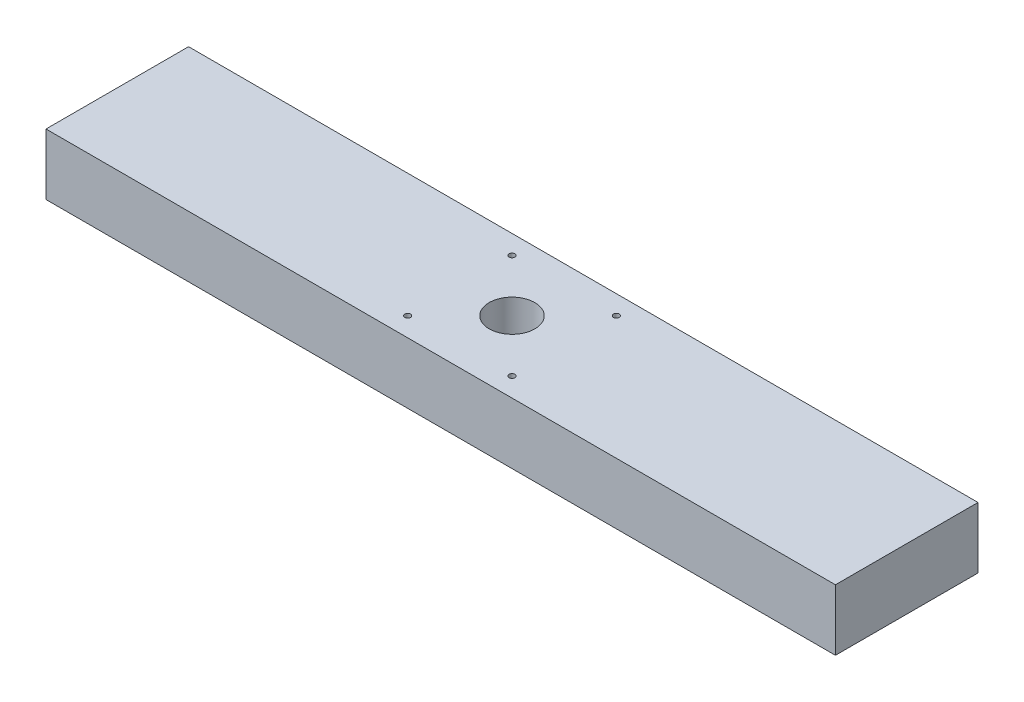
ISO-10303-21;
HEADER;
FILE_DESCRIPTION(('STEP AP214'),'2;1');
FILE_NAME('part.step','',(''),(''),'','','');
FILE_SCHEMA(('AUTOMOTIVE_DESIGN { 1 0 10303 214 1 1 1 1 }'));
ENDSEC;
DATA;
#1=APPLICATION_CONTEXT('core data for automotive mechanical design processes');
#2=APPLICATION_PROTOCOL_DEFINITION('international standard','automotive_design',2000,#1);
#3=PRODUCT_CONTEXT('',#1,'mechanical');
#4=PRODUCT('Part','Part','',(#3));
#5=PRODUCT_RELATED_PRODUCT_CATEGORY('part','',(#4));
#6=PRODUCT_DEFINITION_FORMATION('','',#4);
#7=PRODUCT_DEFINITION_CONTEXT('part definition',#1,'design');
#8=PRODUCT_DEFINITION('design','',#6,#7);
#9=PRODUCT_DEFINITION_SHAPE('','',#8);
#10=(LENGTH_UNIT() NAMED_UNIT(*) SI_UNIT(.MILLI.,.METRE.));
#11=(NAMED_UNIT(*) PLANE_ANGLE_UNIT() SI_UNIT($,.RADIAN.));
#12=(NAMED_UNIT(*) SI_UNIT($,.STERADIAN.) SOLID_ANGLE_UNIT());
#13=UNCERTAINTY_MEASURE_WITH_UNIT(LENGTH_MEASURE(1.E-05),#10,'distance_accuracy_value','');
#14=(GEOMETRIC_REPRESENTATION_CONTEXT(3) GLOBAL_UNCERTAINTY_ASSIGNED_CONTEXT((#13)) GLOBAL_UNIT_ASSIGNED_CONTEXT((#10,
#11,#12)) REPRESENTATION_CONTEXT('',''));
#15=CARTESIAN_POINT('',(0.,0.,0.));
#16=DIRECTION('',(0.,0.,1.));
#17=DIRECTION('',(1.,0.,0.));
#18=AXIS2_PLACEMENT_3D('',#15,#16,#17);
#19=CARTESIAN_POINT('',(-246.126,38.1,44.45));
#20=DIRECTION('',(1.,0.,0.));
#21=DIRECTION('',(0.,0.,-1.));
#22=AXIS2_PLACEMENT_3D('',#19,#20,#21);
#23=PLANE('',#22);
#24=DIRECTION('',(0.,0.,1.));
#25=VECTOR('',#24,1.);
#26=CARTESIAN_POINT('',(-246.126,0.,44.45));
#27=LINE('',#26,#25);
#28=CARTESIAN_POINT('',(-246.126,0.,-44.45));
#29=VERTEX_POINT('',#28);
#30=CARTESIAN_POINT('',(-246.126,0.,44.45));
#31=VERTEX_POINT('',#30);
#32=EDGE_CURVE('E96',#29,#31,#27,.T.);
#33=ORIENTED_EDGE('',*,*,#32,.T.);
#34=DIRECTION('',(0.,-1.,0.));
#35=VECTOR('',#34,1.);
#36=CARTESIAN_POINT('',(-246.126,38.1,44.45));
#37=LINE('',#36,#35);
#38=CARTESIAN_POINT('',(-246.126,38.1,44.45));
#39=VERTEX_POINT('',#38);
#40=EDGE_CURVE('E11',#39,#31,#37,.T.);
#41=ORIENTED_EDGE('',*,*,#40,.F.);
#42=DIRECTION('',(0.,0.,1.));
#43=VECTOR('',#42,1.);
#44=CARTESIAN_POINT('',(-246.126,38.1,44.45));
#45=LINE('',#44,#43);
#46=CARTESIAN_POINT('',(-246.126,38.1,-44.45));
#47=VERTEX_POINT('',#46);
#48=EDGE_CURVE('E84',#47,#39,#45,.T.);
#49=ORIENTED_EDGE('',*,*,#48,.F.);
#50=DIRECTION('',(0.,-1.,0.));
#51=VECTOR('',#50,1.);
#52=CARTESIAN_POINT('',(-246.126,38.1,-44.45));
#53=LINE('',#52,#51);
#54=EDGE_CURVE('E92',#47,#29,#53,.T.);
#55=ORIENTED_EDGE('',*,*,#54,.T.);
#56=EDGE_LOOP('',(#33,#41,#49,#55));
#57=FACE_BOUND('',#56,.T.);
#58=ADVANCED_FACE('F33',(#57),#23,.F.);
#59=CARTESIAN_POINT('',(246.126,38.1,44.45));
#60=DIRECTION('',(0.,0.,-1.));
#61=DIRECTION('',(-1.,0.,0.));
#62=AXIS2_PLACEMENT_3D('',#59,#60,#61);
#63=PLANE('',#62);
#64=DIRECTION('',(1.,0.,0.));
#65=VECTOR('',#64,1.);
#66=CARTESIAN_POINT('',(246.126,0.,44.45));
#67=LINE('',#66,#65);
#68=CARTESIAN_POINT('',(246.126,0.,44.45));
#69=VERTEX_POINT('',#68);
#70=EDGE_CURVE('E88',#31,#69,#67,.T.);
#71=ORIENTED_EDGE('',*,*,#70,.T.);
#72=DIRECTION('',(0.,-1.,0.));
#73=VECTOR('',#72,1.);
#74=CARTESIAN_POINT('',(246.126,38.1,44.45));
#75=LINE('',#74,#73);
#76=CARTESIAN_POINT('',(246.126,38.1,44.45));
#77=VERTEX_POINT('',#76);
#78=EDGE_CURVE('E41',#77,#69,#75,.T.);
#79=ORIENTED_EDGE('',*,*,#78,.F.);
#80=DIRECTION('',(1.,0.,0.));
#81=VECTOR('',#80,1.);
#82=CARTESIAN_POINT('',(246.126,38.1,44.45));
#83=LINE('',#82,#81);
#84=EDGE_CURVE('E79',#39,#77,#83,.T.);
#85=ORIENTED_EDGE('',*,*,#84,.F.);
#86=ORIENTED_EDGE('',*,*,#40,.T.);
#87=EDGE_LOOP('',(#71,#79,#85,#86));
#88=FACE_BOUND('',#87,.T.);
#89=ADVANCED_FACE('F87',(#88),#63,.F.);
#90=CARTESIAN_POINT('',(246.126,38.1,44.45));
#91=DIRECTION('',(-1.,0.,0.));
#92=DIRECTION('',(0.,0.,1.));
#93=AXIS2_PLACEMENT_3D('',#90,#91,#92);
#94=PLANE('',#93);
#95=DIRECTION('',(0.,0.,-1.));
#96=VECTOR('',#95,1.);
#97=CARTESIAN_POINT('',(246.126,0.,44.45));
#98=LINE('',#97,#96);
#99=CARTESIAN_POINT('',(246.126,0.,-44.45));
#100=VERTEX_POINT('',#99);
#101=EDGE_CURVE('E66',#69,#100,#98,.T.);
#102=ORIENTED_EDGE('',*,*,#101,.T.);
#103=DIRECTION('',(0.,-1.,0.));
#104=VECTOR('',#103,1.);
#105=CARTESIAN_POINT('',(246.126,38.1,-44.45));
#106=LINE('',#105,#104);
#107=CARTESIAN_POINT('',(246.126,38.1,-44.45));
#108=VERTEX_POINT('',#107);
#109=EDGE_CURVE('E89',#108,#100,#106,.T.);
#110=ORIENTED_EDGE('',*,*,#109,.F.);
#111=DIRECTION('',(0.,0.,-1.));
#112=VECTOR('',#111,1.);
#113=CARTESIAN_POINT('',(246.126,38.1,44.45));
#114=LINE('',#113,#112);
#115=EDGE_CURVE('E82',#77,#108,#114,.T.);
#116=ORIENTED_EDGE('',*,*,#115,.F.);
#117=ORIENTED_EDGE('',*,*,#78,.T.);
#118=EDGE_LOOP('',(#102,#110,#116,#117));
#119=FACE_BOUND('',#118,.T.);
#120=ADVANCED_FACE('F90',(#119),#94,.F.);
#121=CARTESIAN_POINT('',(246.126,38.1,-44.45));
#122=DIRECTION('',(0.,0.,1.));
#123=DIRECTION('',(1.,0.,0.));
#124=AXIS2_PLACEMENT_3D('',#121,#122,#123);
#125=PLANE('',#124);
#126=DIRECTION('',(-1.,0.,0.));
#127=VECTOR('',#126,1.);
#128=CARTESIAN_POINT('',(246.126,0.,-44.45));
#129=LINE('',#128,#127);
#130=EDGE_CURVE('E72',#100,#29,#129,.T.);
#131=ORIENTED_EDGE('',*,*,#130,.T.);
#132=ORIENTED_EDGE('',*,*,#54,.F.);
#133=DIRECTION('',(-1.,0.,0.));
#134=VECTOR('',#133,1.);
#135=CARTESIAN_POINT('',(246.126,38.1,-44.45));
#136=LINE('',#135,#134);
#137=EDGE_CURVE('E49',#108,#47,#136,.T.);
#138=ORIENTED_EDGE('',*,*,#137,.F.);
#139=ORIENTED_EDGE('',*,*,#109,.T.);
#140=EDGE_LOOP('',(#131,#132,#138,#139));
#141=FACE_BOUND('',#140,.T.);
#142=ADVANCED_FACE('F104',(#141),#125,.F.);
#143=CARTESIAN_POINT('',(0.,38.1,0.));
#144=DIRECTION('',(0.,1.,0.));
#145=DIRECTION('',(0.,0.,1.));
#146=AXIS2_PLACEMENT_3D('',#143,#144,#145);
#147=PLANE('',#146);
#148=CARTESIAN_POINT('',(0.,38.1,0.));
#149=DIRECTION('',(0.,1.,0.));
#150=DIRECTION('',(0.,0.,1.));
#151=AXIS2_PLACEMENT_3D('',#148,#149,#150);
#152=CIRCLE('',#151,14.224);
#153=CARTESIAN_POINT('',(0.,38.1,14.224));
#154=VERTEX_POINT('',#153);
#155=EDGE_CURVE('E134',#154,#154,#152,.T.);
#156=ORIENTED_EDGE('',*,*,#155,.F.);
#157=EDGE_LOOP('',(#156));
#158=FACE_BOUND('',#157,.T.);
#159=CARTESIAN_POINT('',(32.5501,38.1,-32.5501));
#160=DIRECTION('',(0.,1.,0.));
#161=DIRECTION('',(0.,0.,1.));
#162=AXIS2_PLACEMENT_3D('',#159,#160,#161);
#163=CIRCLE('',#162,1.8288);
#164=CARTESIAN_POINT('',(32.5501,38.1,-30.7213));
#165=VERTEX_POINT('',#164);
#166=EDGE_CURVE('E128',#165,#165,#163,.T.);
#167=ORIENTED_EDGE('',*,*,#166,.F.);
#168=EDGE_LOOP('',(#167));
#169=FACE_BOUND('',#168,.T.);
#170=CARTESIAN_POINT('',(32.5501,38.1,32.5501));
#171=DIRECTION('',(0.,1.,0.));
#172=DIRECTION('',(0.,0.,1.));
#173=AXIS2_PLACEMENT_3D('',#170,#171,#172);
#174=CIRCLE('',#173,1.8288);
#175=CARTESIAN_POINT('',(32.5501,38.1,34.3789));
#176=VERTEX_POINT('',#175);
#177=EDGE_CURVE('E122',#176,#176,#174,.T.);
#178=ORIENTED_EDGE('',*,*,#177,.F.);
#179=EDGE_LOOP('',(#178));
#180=FACE_BOUND('',#179,.T.);
#181=CARTESIAN_POINT('',(-32.5501,38.1,32.5501));
#182=DIRECTION('',(0.,1.,0.));
#183=DIRECTION('',(0.,0.,1.));
#184=AXIS2_PLACEMENT_3D('',#181,#182,#183);
#185=CIRCLE('',#184,1.8288);
#186=CARTESIAN_POINT('',(-32.5501,38.1,34.3789));
#187=VERTEX_POINT('',#186);
#188=EDGE_CURVE('E116',#187,#187,#185,.T.);
#189=ORIENTED_EDGE('',*,*,#188,.F.);
#190=EDGE_LOOP('',(#189));
#191=FACE_BOUND('',#190,.T.);
#192=CARTESIAN_POINT('',(-32.5501,38.1,-32.5501));
#193=DIRECTION('',(0.,1.,0.));
#194=DIRECTION('',(0.,0.,1.));
#195=AXIS2_PLACEMENT_3D('',#192,#193,#194);
#196=CIRCLE('',#195,1.8288);
#197=CARTESIAN_POINT('',(-32.5501,38.1,-30.7213));
#198=VERTEX_POINT('',#197);
#199=EDGE_CURVE('E110',#198,#198,#196,.T.);
#200=ORIENTED_EDGE('',*,*,#199,.F.);
#201=EDGE_LOOP('',(#200));
#202=FACE_BOUND('',#201,.T.);
#203=ORIENTED_EDGE('',*,*,#48,.T.);
#204=ORIENTED_EDGE('',*,*,#84,.T.);
#205=ORIENTED_EDGE('',*,*,#115,.T.);
#206=ORIENTED_EDGE('',*,*,#137,.T.);
#207=EDGE_LOOP('',(#203,#204,#205,#206));
#208=FACE_BOUND('',#207,.T.);
#209=ADVANCED_FACE('F80',(#158,#169,#180,#191,#202,#208),#147,.T.);
#210=CARTESIAN_POINT('',(0.,0.,0.));
#211=DIRECTION('',(0.,1.,0.));
#212=DIRECTION('',(0.,0.,1.));
#213=AXIS2_PLACEMENT_3D('',#210,#211,#212);
#214=PLANE('',#213);
#215=CARTESIAN_POINT('',(0.,0.,0.));
#216=DIRECTION('',(0.,1.,0.));
#217=DIRECTION('',(0.,0.,1.));
#218=AXIS2_PLACEMENT_3D('',#215,#216,#217);
#219=CIRCLE('',#218,14.224);
#220=CARTESIAN_POINT('',(0.,0.,14.224));
#221=VERTEX_POINT('',#220);
#222=EDGE_CURVE('E131',#221,#221,#219,.T.);
#223=ORIENTED_EDGE('',*,*,#222,.T.);
#224=EDGE_LOOP('',(#223));
#225=FACE_BOUND('',#224,.T.);
#226=CARTESIAN_POINT('',(32.5501,0.,-32.5501));
#227=DIRECTION('',(0.,1.,0.));
#228=DIRECTION('',(0.,0.,1.));
#229=AXIS2_PLACEMENT_3D('',#226,#227,#228);
#230=CIRCLE('',#229,1.8288);
#231=CARTESIAN_POINT('',(32.5501,0.,-30.7213));
#232=VERTEX_POINT('',#231);
#233=EDGE_CURVE('E125',#232,#232,#230,.T.);
#234=ORIENTED_EDGE('',*,*,#233,.T.);
#235=EDGE_LOOP('',(#234));
#236=FACE_BOUND('',#235,.T.);
#237=CARTESIAN_POINT('',(32.5501,0.,32.5501));
#238=DIRECTION('',(0.,1.,0.));
#239=DIRECTION('',(0.,0.,1.));
#240=AXIS2_PLACEMENT_3D('',#237,#238,#239);
#241=CIRCLE('',#240,1.8288);
#242=CARTESIAN_POINT('',(32.5501,0.,34.3789));
#243=VERTEX_POINT('',#242);
#244=EDGE_CURVE('E119',#243,#243,#241,.T.);
#245=ORIENTED_EDGE('',*,*,#244,.T.);
#246=EDGE_LOOP('',(#245));
#247=FACE_BOUND('',#246,.T.);
#248=CARTESIAN_POINT('',(-32.5501,0.,32.5501));
#249=DIRECTION('',(0.,1.,0.));
#250=DIRECTION('',(0.,0.,1.));
#251=AXIS2_PLACEMENT_3D('',#248,#249,#250);
#252=CIRCLE('',#251,1.8288);
#253=CARTESIAN_POINT('',(-32.5501,0.,34.3789));
#254=VERTEX_POINT('',#253);
#255=EDGE_CURVE('E113',#254,#254,#252,.T.);
#256=ORIENTED_EDGE('',*,*,#255,.T.);
#257=EDGE_LOOP('',(#256));
#258=FACE_BOUND('',#257,.T.);
#259=CARTESIAN_POINT('',(-32.5501,0.,-32.5501));
#260=DIRECTION('',(0.,1.,0.));
#261=DIRECTION('',(0.,0.,1.));
#262=AXIS2_PLACEMENT_3D('',#259,#260,#261);
#263=CIRCLE('',#262,1.8288);
#264=CARTESIAN_POINT('',(-32.5501,0.,-30.7213));
#265=VERTEX_POINT('',#264);
#266=EDGE_CURVE('E99',#265,#265,#263,.T.);
#267=ORIENTED_EDGE('',*,*,#266,.T.);
#268=EDGE_LOOP('',(#267));
#269=FACE_BOUND('',#268,.T.);
#270=ORIENTED_EDGE('',*,*,#32,.F.);
#271=ORIENTED_EDGE('',*,*,#130,.F.);
#272=ORIENTED_EDGE('',*,*,#101,.F.);
#273=ORIENTED_EDGE('',*,*,#70,.F.);
#274=EDGE_LOOP('',(#270,#271,#272,#273));
#275=FACE_BOUND('',#274,.T.);
#276=ADVANCED_FACE('F107',(#225,#236,#247,#258,#269,#275),#214,.F.);
#277=CARTESIAN_POINT('',(-32.5501,0.,-32.5501));
#278=DIRECTION('',(0.,1.,0.));
#279=DIRECTION('',(0.,0.,1.));
#280=AXIS2_PLACEMENT_3D('',#277,#278,#279);
#281=CYLINDRICAL_SURFACE('',#280,1.8288);
#282=ORIENTED_EDGE('',*,*,#266,.F.);
#283=EDGE_LOOP('',(#282));
#284=FACE_BOUND('',#283,.T.);
#285=ORIENTED_EDGE('',*,*,#199,.T.);
#286=EDGE_LOOP('',(#285));
#287=FACE_BOUND('',#286,.T.);
#288=ADVANCED_FACE('F160',(#284,#287),#281,.F.);
#289=CARTESIAN_POINT('',(-32.5501,0.,32.5501));
#290=DIRECTION('',(0.,1.,0.));
#291=DIRECTION('',(0.,0.,1.));
#292=AXIS2_PLACEMENT_3D('',#289,#290,#291);
#293=CYLINDRICAL_SURFACE('',#292,1.8288);
#294=ORIENTED_EDGE('',*,*,#255,.F.);
#295=EDGE_LOOP('',(#294));
#296=FACE_BOUND('',#295,.T.);
#297=ORIENTED_EDGE('',*,*,#188,.T.);
#298=EDGE_LOOP('',(#297));
#299=FACE_BOUND('',#298,.T.);
#300=ADVANCED_FACE('F162',(#296,#299),#293,.F.);
#301=CARTESIAN_POINT('',(32.5501,0.,32.5501));
#302=DIRECTION('',(0.,1.,0.));
#303=DIRECTION('',(0.,0.,1.));
#304=AXIS2_PLACEMENT_3D('',#301,#302,#303);
#305=CYLINDRICAL_SURFACE('',#304,1.8288);
#306=ORIENTED_EDGE('',*,*,#244,.F.);
#307=EDGE_LOOP('',(#306));
#308=FACE_BOUND('',#307,.T.);
#309=ORIENTED_EDGE('',*,*,#177,.T.);
#310=EDGE_LOOP('',(#309));
#311=FACE_BOUND('',#310,.T.);
#312=ADVANCED_FACE('F169',(#308,#311),#305,.F.);
#313=CARTESIAN_POINT('',(32.5501,0.,-32.5501));
#314=DIRECTION('',(0.,1.,0.));
#315=DIRECTION('',(0.,0.,1.));
#316=AXIS2_PLACEMENT_3D('',#313,#314,#315);
#317=CYLINDRICAL_SURFACE('',#316,1.8288);
#318=ORIENTED_EDGE('',*,*,#233,.F.);
#319=EDGE_LOOP('',(#318));
#320=FACE_BOUND('',#319,.T.);
#321=ORIENTED_EDGE('',*,*,#166,.T.);
#322=EDGE_LOOP('',(#321));
#323=FACE_BOUND('',#322,.T.);
#324=ADVANCED_FACE('F145',(#320,#323),#317,.F.);
#325=CARTESIAN_POINT('',(0.,0.,0.));
#326=DIRECTION('',(0.,1.,0.));
#327=DIRECTION('',(0.,0.,1.));
#328=AXIS2_PLACEMENT_3D('',#325,#326,#327);
#329=CYLINDRICAL_SURFACE('',#328,14.224);
#330=ORIENTED_EDGE('',*,*,#222,.F.);
#331=EDGE_LOOP('',(#330));
#332=FACE_BOUND('',#331,.T.);
#333=ORIENTED_EDGE('',*,*,#155,.T.);
#334=EDGE_LOOP('',(#333));
#335=FACE_BOUND('',#334,.T.);
#336=ADVANCED_FACE('F142',(#332,#335),#329,.F.);
#337=CLOSED_SHELL('',(#58,#89,#120,#142,#209,#276,#288,#300,#312,#324,#336));
#338=MANIFOLD_SOLID_BREP('B2',#337);
#339=ADVANCED_BREP_SHAPE_REPRESENTATION('',(#18,#338),#14);
#340=SHAPE_DEFINITION_REPRESENTATION(#9,#339);
ENDSEC;
END-ISO-10303-21;
